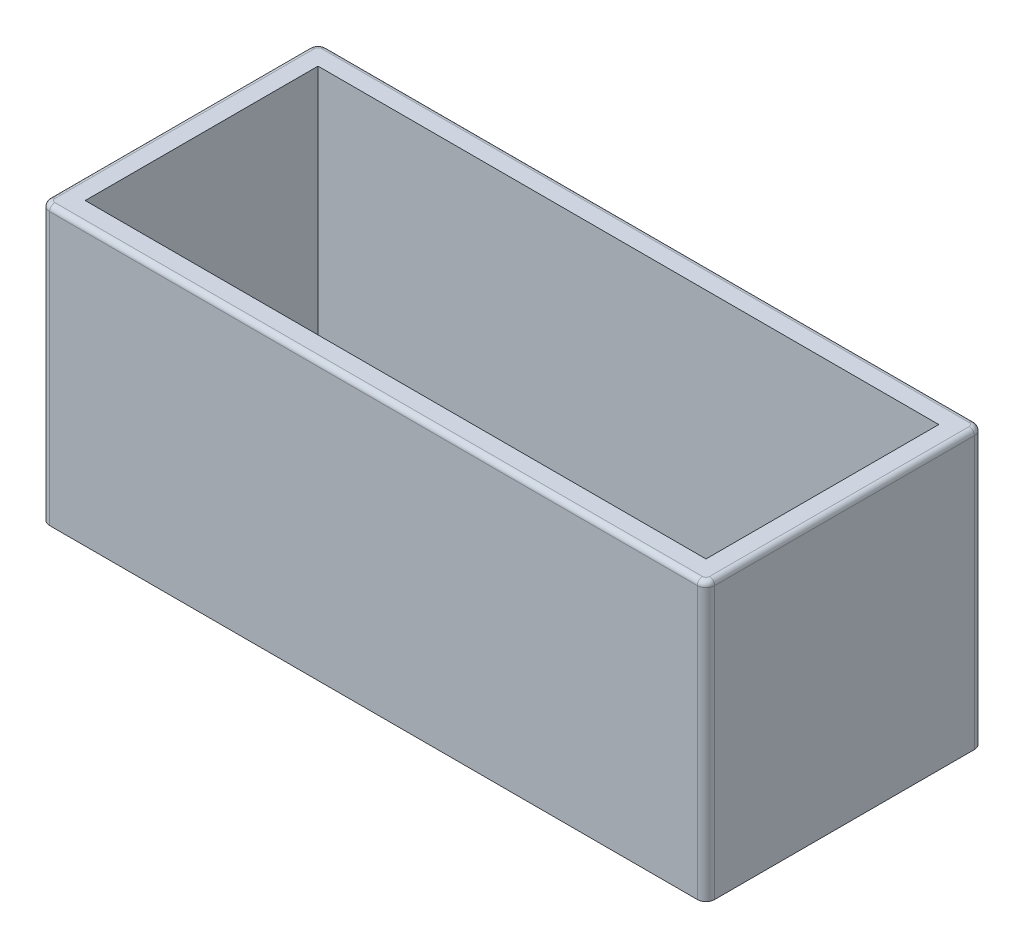
ISO-10303-21;
HEADER;
FILE_DESCRIPTION(('STEP AP214'),'2;1');
FILE_NAME('part.step','',(''),(''),'','','');
FILE_SCHEMA(('AUTOMOTIVE_DESIGN { 1 0 10303 214 1 1 1 1 }'));
ENDSEC;
DATA;
#1=APPLICATION_CONTEXT('core data for automotive mechanical design processes');
#2=APPLICATION_PROTOCOL_DEFINITION('international standard','automotive_design',2000,#1);
#3=PRODUCT_CONTEXT('',#1,'mechanical');
#4=PRODUCT('Part','Part','',(#3));
#5=PRODUCT_RELATED_PRODUCT_CATEGORY('part','',(#4));
#6=PRODUCT_DEFINITION_FORMATION('','',#4);
#7=PRODUCT_DEFINITION_CONTEXT('part definition',#1,'design');
#8=PRODUCT_DEFINITION('design','',#6,#7);
#9=PRODUCT_DEFINITION_SHAPE('','',#8);
#10=(LENGTH_UNIT() NAMED_UNIT(*) SI_UNIT(.MILLI.,.METRE.));
#11=(NAMED_UNIT(*) PLANE_ANGLE_UNIT() SI_UNIT($,.RADIAN.));
#12=(NAMED_UNIT(*) SI_UNIT($,.STERADIAN.) SOLID_ANGLE_UNIT());
#13=UNCERTAINTY_MEASURE_WITH_UNIT(LENGTH_MEASURE(1.E-05),#10,'distance_accuracy_value','');
#14=(GEOMETRIC_REPRESENTATION_CONTEXT(3) GLOBAL_UNCERTAINTY_ASSIGNED_CONTEXT((#13)) GLOBAL_UNIT_ASSIGNED_CONTEXT((#10,
#11,#12)) REPRESENTATION_CONTEXT('',''));
#15=CARTESIAN_POINT('',(0.,0.,0.));
#16=DIRECTION('',(0.,0.,1.));
#17=DIRECTION('',(1.,0.,0.));
#18=AXIS2_PLACEMENT_3D('',#15,#16,#17);
#19=CARTESIAN_POINT('',(80.772,-8.1191791947345,-1.905));
#20=DIRECTION('',(0.,0.,1.));
#21=DIRECTION('',(1.,0.,0.));
#22=AXIS2_PLACEMENT_3D('',#19,#20,#21);
#23=PLANE('',#22);
#24=DIRECTION('',(0.,1.,0.));
#25=VECTOR('',#24,1.);
#26=CARTESIAN_POINT('',(71.748,-4.30917919473451,-1.905));
#27=LINE('',#26,#25);
#28=CARTESIAN_POINT('',(71.748,-8.1191791947345,-1.905));
#29=VERTEX_POINT('',#28);
#30=CARTESIAN_POINT('',(71.748,-4.3811791947345,-1.905));
#31=VERTEX_POINT('',#30);
#32=EDGE_CURVE('E231',#29,#31,#27,.T.);
#33=ORIENTED_EDGE('',*,*,#32,.T.);
#34=DIRECTION('',(-1.,0.,0.));
#35=VECTOR('',#34,1.);
#36=CARTESIAN_POINT('',(80.772,-4.3811791947345,-1.905));
#37=LINE('',#36,#35);
#38=CARTESIAN_POINT('',(80.652,-4.3811791947345,-1.905));
#39=VERTEX_POINT('',#38);
#40=EDGE_CURVE('E12',#31,#39,#37,.F.);
#41=ORIENTED_EDGE('',*,*,#40,.T.);
#42=DIRECTION('',(0.,1.,0.));
#43=VECTOR('',#42,1.);
#44=CARTESIAN_POINT('',(80.652,-8.1191791947345,-1.905));
#45=LINE('',#44,#43);
#46=CARTESIAN_POINT('',(80.652,-8.1191791947345,-1.905));
#47=VERTEX_POINT('',#46);
#48=EDGE_CURVE('E233',#39,#47,#45,.F.);
#49=ORIENTED_EDGE('',*,*,#48,.T.);
#50=DIRECTION('',(-1.,0.,0.));
#51=VECTOR('',#50,1.);
#52=CARTESIAN_POINT('',(80.772,-8.1191791947345,-1.905));
#53=LINE('',#52,#51);
#54=EDGE_CURVE('E205',#47,#29,#53,.T.);
#55=ORIENTED_EDGE('',*,*,#54,.T.);
#56=EDGE_LOOP('',(#33,#41,#49,#55));
#57=FACE_BOUND('',#56,.T.);
#58=ADVANCED_FACE('F49',(#57),#23,.F.);
#59=CARTESIAN_POINT('',(80.772,-4.30917919473451,1.90499999999999));
#60=DIRECTION('',(0.,-1.,0.));
#61=DIRECTION('',(0.,0.,-1.));
#62=AXIS2_PLACEMENT_3D('',#59,#60,#61);
#63=PLANE('',#62);
#64=DIRECTION('',(0.,0.,1.));
#65=VECTOR('',#64,1.);
#66=CARTESIAN_POINT('',(80.7,-4.30917919473451,1.90499999999999));
#67=LINE('',#66,#65);
#68=CARTESIAN_POINT('',(80.7,-4.30917919473451,1.78499999999999));
#69=VERTEX_POINT('',#68);
#70=CARTESIAN_POINT('',(80.7,-4.30917919473451,-1.78500000000001));
#71=VERTEX_POINT('',#70);
#72=EDGE_CURVE('E251',#69,#71,#67,.F.);
#73=ORIENTED_EDGE('',*,*,#72,.T.);
#74=CARTESIAN_POINT('',(80.652,-4.30917919473451,-1.78500000000001));
#75=DIRECTION('',(0.,-1.,0.));
#76=DIRECTION('',(0.,0.,-1.));
#77=AXIS2_PLACEMENT_3D('',#74,#75,#76);
#78=CIRCLE('',#77,0.048);
#79=CARTESIAN_POINT('',(80.652,-4.30917919473451,-1.83300000000001));
#80=VERTEX_POINT('',#79);
#81=EDGE_CURVE('E253',#71,#80,#78,.F.);
#82=ORIENTED_EDGE('',*,*,#81,.T.);
#83=DIRECTION('',(-1.,0.,0.));
#84=VECTOR('',#83,1.);
#85=CARTESIAN_POINT('',(80.772,-4.30917919473451,-1.83300000000001));
#86=LINE('',#85,#84);
#87=CARTESIAN_POINT('',(71.748,-4.30917919473451,-1.83300000000001));
#88=VERTEX_POINT('',#87);
#89=EDGE_CURVE('E239',#80,#88,#86,.T.);
#90=ORIENTED_EDGE('',*,*,#89,.T.);
#91=CARTESIAN_POINT('',(71.748,-4.30917919473451,-1.78500000000001));
#92=DIRECTION('',(0.,-1.,0.));
#93=DIRECTION('',(0.,0.,-1.));
#94=AXIS2_PLACEMENT_3D('',#91,#92,#93);
#95=CIRCLE('',#94,0.048);
#96=CARTESIAN_POINT('',(71.7,-4.30917919473451,-1.78500000000001));
#97=VERTEX_POINT('',#96);
#98=EDGE_CURVE('E241',#88,#97,#95,.F.);
#99=ORIENTED_EDGE('',*,*,#98,.T.);
#100=DIRECTION('',(0.,0.,1.));
#101=VECTOR('',#100,1.);
#102=CARTESIAN_POINT('',(71.7,-4.30917919473451,1.78499999999999));
#103=LINE('',#102,#101);
#104=CARTESIAN_POINT('',(71.7,-4.30917919473451,1.78499999999999));
#105=VERTEX_POINT('',#104);
#106=EDGE_CURVE('E243',#97,#105,#103,.T.);
#107=ORIENTED_EDGE('',*,*,#106,.T.);
#108=CARTESIAN_POINT('',(71.748,-4.30917919473451,1.78499999999999));
#109=DIRECTION('',(0.,-1.,0.));
#110=DIRECTION('',(0.,0.,-1.));
#111=AXIS2_PLACEMENT_3D('',#108,#109,#110);
#112=CIRCLE('',#111,0.048);
#113=CARTESIAN_POINT('',(71.748,-4.30917919473451,1.83299999999999));
#114=VERTEX_POINT('',#113);
#115=EDGE_CURVE('E245',#105,#114,#112,.F.);
#116=ORIENTED_EDGE('',*,*,#115,.T.);
#117=DIRECTION('',(-1.,0.,0.));
#118=VECTOR('',#117,1.);
#119=CARTESIAN_POINT('',(80.772,-4.30917919473451,1.83299999999999));
#120=LINE('',#119,#118);
#121=CARTESIAN_POINT('',(80.652,-4.30917919473451,1.83299999999999));
#122=VERTEX_POINT('',#121);
#123=EDGE_CURVE('E247',#114,#122,#120,.F.);
#124=ORIENTED_EDGE('',*,*,#123,.T.);
#125=CARTESIAN_POINT('',(80.652,-4.30917919473451,1.78499999999999));
#126=DIRECTION('',(0.,-1.,0.));
#127=DIRECTION('',(0.,0.,-1.));
#128=AXIS2_PLACEMENT_3D('',#125,#126,#127);
#129=CIRCLE('',#128,0.048);
#130=EDGE_CURVE('E249',#122,#69,#129,.F.);
#131=ORIENTED_EDGE('',*,*,#130,.T.);
#132=EDGE_LOOP('',(#73,#82,#90,#99,#107,#116,#124,#131));
#133=FACE_BOUND('',#132,.T.);
#134=DIRECTION('',(0.,0.,1.));
#135=VECTOR('',#134,1.);
#136=CARTESIAN_POINT('',(71.9328,-4.30917919473451,-1.60020000000001));
#137=LINE('',#136,#135);
#138=CARTESIAN_POINT('',(71.9328,-4.30917919473451,-1.60020000000001));
#139=VERTEX_POINT('',#138);
#140=CARTESIAN_POINT('',(71.9328,-4.30917919473451,1.60019999999999));
#141=VERTEX_POINT('',#140);
#142=EDGE_CURVE('E180',#139,#141,#137,.T.);
#143=ORIENTED_EDGE('',*,*,#142,.F.);
#144=DIRECTION('',(-1.,0.,0.));
#145=VECTOR('',#144,1.);
#146=CARTESIAN_POINT('',(80.4672,-4.30917919473451,-1.60020000000001));
#147=LINE('',#146,#145);
#148=CARTESIAN_POINT('',(80.4672,-4.30917919473451,-1.60020000000001));
#149=VERTEX_POINT('',#148);
#150=EDGE_CURVE('E185',#149,#139,#147,.T.);
#151=ORIENTED_EDGE('',*,*,#150,.F.);
#152=DIRECTION('',(0.,0.,-1.));
#153=VECTOR('',#152,1.);
#154=CARTESIAN_POINT('',(80.4672,-4.30917919473451,1.60019999999999));
#155=LINE('',#154,#153);
#156=CARTESIAN_POINT('',(80.4672,-4.30917919473451,1.60019999999999));
#157=VERTEX_POINT('',#156);
#158=EDGE_CURVE('E189',#157,#149,#155,.T.);
#159=ORIENTED_EDGE('',*,*,#158,.F.);
#160=DIRECTION('',(1.,0.,0.));
#161=VECTOR('',#160,1.);
#162=CARTESIAN_POINT('',(71.9328,-4.30917919473451,1.60019999999999));
#163=LINE('',#162,#161);
#164=EDGE_CURVE('E169',#141,#157,#163,.T.);
#165=ORIENTED_EDGE('',*,*,#164,.F.);
#166=EDGE_LOOP('',(#143,#151,#159,#165));
#167=FACE_BOUND('',#166,.T.);
#168=ADVANCED_FACE('F187',(#133,#167),#63,.F.);
#169=CARTESIAN_POINT('',(80.772,-8.1191791947345,1.90499999999999));
#170=DIRECTION('',(0.,0.,-1.));
#171=DIRECTION('',(-1.,0.,0.));
#172=AXIS2_PLACEMENT_3D('',#169,#170,#171);
#173=PLANE('',#172);
#174=DIRECTION('',(0.,-1.,0.));
#175=VECTOR('',#174,1.);
#176=CARTESIAN_POINT('',(80.652,-8.1191791947345,1.90499999999999));
#177=LINE('',#176,#175);
#178=CARTESIAN_POINT('',(80.652,-8.1191791947345,1.90499999999999));
#179=VERTEX_POINT('',#178);
#180=CARTESIAN_POINT('',(80.652,-4.3811791947345,1.90499999999999));
#181=VERTEX_POINT('',#180);
#182=EDGE_CURVE('E228',#179,#181,#177,.F.);
#183=ORIENTED_EDGE('',*,*,#182,.T.);
#184=DIRECTION('',(-1.,0.,0.));
#185=VECTOR('',#184,1.);
#186=CARTESIAN_POINT('',(80.772,-4.3811791947345,1.90499999999999));
#187=LINE('',#186,#185);
#188=CARTESIAN_POINT('',(71.748,-4.3811791947345,1.90499999999999));
#189=VERTEX_POINT('',#188);
#190=EDGE_CURVE('E263',#181,#189,#187,.T.);
#191=ORIENTED_EDGE('',*,*,#190,.T.);
#192=DIRECTION('',(0.,-1.,0.));
#193=VECTOR('',#192,1.);
#194=CARTESIAN_POINT('',(71.748,-8.1191791947345,1.90499999999999));
#195=LINE('',#194,#193);
#196=CARTESIAN_POINT('',(71.748,-8.1191791947345,1.90499999999999));
#197=VERTEX_POINT('',#196);
#198=EDGE_CURVE('E226',#189,#197,#195,.T.);
#199=ORIENTED_EDGE('',*,*,#198,.T.);
#200=DIRECTION('',(-1.,0.,0.));
#201=VECTOR('',#200,1.);
#202=CARTESIAN_POINT('',(80.772,-8.1191791947345,1.90499999999999));
#203=LINE('',#202,#201);
#204=EDGE_CURVE('E210',#179,#197,#203,.T.);
#205=ORIENTED_EDGE('',*,*,#204,.F.);
#206=EDGE_LOOP('',(#183,#191,#199,#205));
#207=FACE_BOUND('',#206,.T.);
#208=ADVANCED_FACE('F325',(#207),#173,.F.);
#209=CARTESIAN_POINT('',(80.772,-8.1191791947345,1.90499999999999));
#210=DIRECTION('',(0.,1.,0.));
#211=DIRECTION('',(0.,0.,1.));
#212=AXIS2_PLACEMENT_3D('',#209,#210,#211);
#213=PLANE('',#212);
#214=DIRECTION('',(0.,0.,-1.));
#215=VECTOR('',#214,1.);
#216=CARTESIAN_POINT('',(80.772,-8.1191791947345,1.90499999999999));
#217=LINE('',#216,#215);
#218=CARTESIAN_POINT('',(80.772,-8.1191791947345,1.78499999999999));
#219=VERTEX_POINT('',#218);
#220=CARTESIAN_POINT('',(80.772,-8.1191791947345,-1.78500000000001));
#221=VERTEX_POINT('',#220);
#222=EDGE_CURVE('E202',#219,#221,#217,.T.);
#223=ORIENTED_EDGE('',*,*,#222,.F.);
#224=CARTESIAN_POINT('',(80.652,-8.1191791947345,1.78499999999999));
#225=DIRECTION('',(0.,1.,0.));
#226=DIRECTION('',(0.,0.,1.));
#227=AXIS2_PLACEMENT_3D('',#224,#225,#226);
#228=CIRCLE('',#227,0.12);
#229=EDGE_CURVE('E224',#219,#179,#228,.F.);
#230=ORIENTED_EDGE('',*,*,#229,.T.);
#231=ORIENTED_EDGE('',*,*,#204,.T.);
#232=CARTESIAN_POINT('',(71.748,-8.1191791947345,1.78499999999999));
#233=DIRECTION('',(0.,1.,0.));
#234=DIRECTION('',(0.,0.,1.));
#235=AXIS2_PLACEMENT_3D('',#232,#233,#234);
#236=CIRCLE('',#235,0.12);
#237=CARTESIAN_POINT('',(71.628,-8.1191791947345,1.78499999999999));
#238=VERTEX_POINT('',#237);
#239=EDGE_CURVE('E218',#197,#238,#236,.F.);
#240=ORIENTED_EDGE('',*,*,#239,.T.);
#241=DIRECTION('',(0.,0.,-1.));
#242=VECTOR('',#241,1.);
#243=CARTESIAN_POINT('',(71.628,-8.1191791947345,1.90499999999999));
#244=LINE('',#243,#242);
#245=CARTESIAN_POINT('',(71.628,-8.1191791947345,-1.78500000000001));
#246=VERTEX_POINT('',#245);
#247=EDGE_CURVE('E200',#238,#246,#244,.T.);
#248=ORIENTED_EDGE('',*,*,#247,.T.);
#249=CARTESIAN_POINT('',(71.748,-8.1191791947345,-1.78500000000001));
#250=DIRECTION('',(0.,1.,0.));
#251=DIRECTION('',(0.,0.,1.));
#252=AXIS2_PLACEMENT_3D('',#249,#250,#251);
#253=CIRCLE('',#252,0.12);
#254=EDGE_CURVE('E220',#246,#29,#253,.F.);
#255=ORIENTED_EDGE('',*,*,#254,.T.);
#256=ORIENTED_EDGE('',*,*,#54,.F.);
#257=CARTESIAN_POINT('',(80.652,-8.1191791947345,-1.78500000000001));
#258=DIRECTION('',(0.,1.,0.));
#259=DIRECTION('',(0.,0.,1.));
#260=AXIS2_PLACEMENT_3D('',#257,#258,#259);
#261=CIRCLE('',#260,0.12);
#262=EDGE_CURVE('E222',#47,#221,#261,.F.);
#263=ORIENTED_EDGE('',*,*,#262,.T.);
#264=EDGE_LOOP('',(#223,#230,#231,#240,#248,#255,#256,#263));
#265=FACE_BOUND('',#264,.T.);
#266=ADVANCED_FACE('F408',(#265),#213,.F.);
#267=CARTESIAN_POINT('',(80.772,-6.2141791947345,0.));
#268=DIRECTION('',(-1.,0.,0.));
#269=DIRECTION('',(0.,0.,1.));
#270=AXIS2_PLACEMENT_3D('',#267,#268,#269);
#271=PLANE('',#270);
#272=DIRECTION('',(0.,1.,0.));
#273=VECTOR('',#272,1.);
#274=CARTESIAN_POINT('',(80.772,-6.2141791947345,-1.78500000000001));
#275=LINE('',#274,#273);
#276=CARTESIAN_POINT('',(80.772,-4.3811791947345,-1.78500000000001));
#277=VERTEX_POINT('',#276);
#278=EDGE_CURVE('E213',#221,#277,#275,.T.);
#279=ORIENTED_EDGE('',*,*,#278,.T.);
#280=DIRECTION('',(0.,0.,1.));
#281=VECTOR('',#280,1.);
#282=CARTESIAN_POINT('',(80.772,-4.3811791947345,0.));
#283=LINE('',#282,#281);
#284=CARTESIAN_POINT('',(80.772,-4.3811791947345,1.78499999999999));
#285=VERTEX_POINT('',#284);
#286=EDGE_CURVE('E259',#277,#285,#283,.T.);
#287=ORIENTED_EDGE('',*,*,#286,.T.);
#288=DIRECTION('',(0.,-1.,0.));
#289=VECTOR('',#288,1.);
#290=CARTESIAN_POINT('',(80.772,-6.2141791947345,1.78499999999999));
#291=LINE('',#290,#289);
#292=EDGE_CURVE('E216',#285,#219,#291,.T.);
#293=ORIENTED_EDGE('',*,*,#292,.T.);
#294=ORIENTED_EDGE('',*,*,#222,.T.);
#295=EDGE_LOOP('',(#279,#287,#293,#294));
#296=FACE_BOUND('',#295,.T.);
#297=ADVANCED_FACE('F315',(#296),#271,.F.);
#298=CARTESIAN_POINT('',(71.628,-6.2141791947345,0.));
#299=DIRECTION('',(-1.,0.,0.));
#300=DIRECTION('',(0.,0.,1.));
#301=AXIS2_PLACEMENT_3D('',#298,#299,#300);
#302=PLANE('',#301);
#303=DIRECTION('',(0.,-1.,0.));
#304=VECTOR('',#303,1.);
#305=CARTESIAN_POINT('',(71.628,-4.30917919473451,1.78499999999999));
#306=LINE('',#305,#304);
#307=CARTESIAN_POINT('',(71.628,-4.3811791947345,1.78499999999999));
#308=VERTEX_POINT('',#307);
#309=EDGE_CURVE('E235',#238,#308,#306,.F.);
#310=ORIENTED_EDGE('',*,*,#309,.T.);
#311=DIRECTION('',(0.,0.,1.));
#312=VECTOR('',#311,1.);
#313=CARTESIAN_POINT('',(71.628,-4.3811791947345,-1.78500000000001));
#314=LINE('',#313,#312);
#315=CARTESIAN_POINT('',(71.628,-4.3811791947345,-1.78500000000001));
#316=VERTEX_POINT('',#315);
#317=EDGE_CURVE('E73',#308,#316,#314,.F.);
#318=ORIENTED_EDGE('',*,*,#317,.T.);
#319=DIRECTION('',(0.,1.,0.));
#320=VECTOR('',#319,1.);
#321=CARTESIAN_POINT('',(71.628,-8.1191791947345,-1.78500000000001));
#322=LINE('',#321,#320);
#323=EDGE_CURVE('E237',#316,#246,#322,.F.);
#324=ORIENTED_EDGE('',*,*,#323,.T.);
#325=ORIENTED_EDGE('',*,*,#247,.F.);
#326=EDGE_LOOP('',(#310,#318,#324,#325));
#327=FACE_BOUND('',#326,.T.);
#328=ADVANCED_FACE('F308',(#327),#302,.T.);
#329=CARTESIAN_POINT('',(80.4672,-17.2339223902393,-1.60020000000001));
#330=DIRECTION('',(0.,0.,-1.));
#331=DIRECTION('',(-1.,0.,0.));
#332=AXIS2_PLACEMENT_3D('',#329,#330,#331);
#333=PLANE('',#332);
#334=DIRECTION('',(1.,0.,0.));
#335=VECTOR('',#334,1.);
#336=CARTESIAN_POINT('',(80.4672,-7.8143791947345,-1.60020000000001));
#337=LINE('',#336,#335);
#338=CARTESIAN_POINT('',(71.9328,-7.8143791947345,-1.60020000000001));
#339=VERTEX_POINT('',#338);
#340=CARTESIAN_POINT('',(80.4672,-7.8143791947345,-1.60020000000001));
#341=VERTEX_POINT('',#340);
#342=EDGE_CURVE('E201',#339,#341,#337,.T.);
#343=ORIENTED_EDGE('',*,*,#342,.T.);
#344=DIRECTION('',(0.,1.,0.));
#345=VECTOR('',#344,1.);
#346=CARTESIAN_POINT('',(80.4672,-17.2339223902393,-1.60020000000001));
#347=LINE('',#346,#345);
#348=EDGE_CURVE('E194',#341,#149,#347,.T.);
#349=ORIENTED_EDGE('',*,*,#348,.T.);
#350=ORIENTED_EDGE('',*,*,#150,.T.);
#351=DIRECTION('',(0.,1.,0.));
#352=VECTOR('',#351,1.);
#353=CARTESIAN_POINT('',(71.9328,-17.2339223902393,-1.60020000000001));
#354=LINE('',#353,#352);
#355=EDGE_CURVE('E176',#339,#139,#354,.T.);
#356=ORIENTED_EDGE('',*,*,#355,.F.);
#357=EDGE_LOOP('',(#343,#349,#350,#356));
#358=FACE_BOUND('',#357,.T.);
#359=ADVANCED_FACE('F306',(#358),#333,.F.);
#360=CARTESIAN_POINT('',(80.4672,-17.2339223902393,1.60019999999999));
#361=DIRECTION('',(1.,0.,0.));
#362=DIRECTION('',(0.,0.,-1.));
#363=AXIS2_PLACEMENT_3D('',#360,#361,#362);
#364=PLANE('',#363);
#365=DIRECTION('',(0.,0.,1.));
#366=VECTOR('',#365,1.);
#367=CARTESIAN_POINT('',(80.4672,-7.8143791947345,1.60019999999999));
#368=LINE('',#367,#366);
#369=CARTESIAN_POINT('',(80.4672,-7.8143791947345,1.60019999999999));
#370=VERTEX_POINT('',#369);
#371=EDGE_CURVE('E297',#341,#370,#368,.T.);
#372=ORIENTED_EDGE('',*,*,#371,.T.);
#373=DIRECTION('',(0.,1.,0.));
#374=VECTOR('',#373,1.);
#375=CARTESIAN_POINT('',(80.4672,-17.2339223902393,1.60019999999999));
#376=LINE('',#375,#374);
#377=EDGE_CURVE('E175',#370,#157,#376,.T.);
#378=ORIENTED_EDGE('',*,*,#377,.T.);
#379=ORIENTED_EDGE('',*,*,#158,.T.);
#380=ORIENTED_EDGE('',*,*,#348,.F.);
#381=EDGE_LOOP('',(#372,#378,#379,#380));
#382=FACE_BOUND('',#381,.T.);
#383=ADVANCED_FACE('F302',(#382),#364,.F.);
#384=CARTESIAN_POINT('',(71.9328,-17.2339223902393,1.60019999999999));
#385=DIRECTION('',(0.,0.,1.));
#386=DIRECTION('',(1.,0.,0.));
#387=AXIS2_PLACEMENT_3D('',#384,#385,#386);
#388=PLANE('',#387);
#389=DIRECTION('',(-1.,0.,0.));
#390=VECTOR('',#389,1.);
#391=CARTESIAN_POINT('',(71.9328,-7.8143791947345,1.60019999999999));
#392=LINE('',#391,#390);
#393=CARTESIAN_POINT('',(71.9328,-7.8143791947345,1.60019999999999));
#394=VERTEX_POINT('',#393);
#395=EDGE_CURVE('E172',#370,#394,#392,.T.);
#396=ORIENTED_EDGE('',*,*,#395,.T.);
#397=DIRECTION('',(0.,1.,0.));
#398=VECTOR('',#397,1.);
#399=CARTESIAN_POINT('',(71.9328,-17.2339223902393,1.60019999999999));
#400=LINE('',#399,#398);
#401=EDGE_CURVE('E164',#394,#141,#400,.T.);
#402=ORIENTED_EDGE('',*,*,#401,.T.);
#403=ORIENTED_EDGE('',*,*,#164,.T.);
#404=ORIENTED_EDGE('',*,*,#377,.F.);
#405=EDGE_LOOP('',(#396,#402,#403,#404));
#406=FACE_BOUND('',#405,.T.);
#407=ADVANCED_FACE('F166',(#406),#388,.F.);
#408=CARTESIAN_POINT('',(71.9328,-17.2339223902393,-1.60020000000001));
#409=DIRECTION('',(-1.,0.,0.));
#410=DIRECTION('',(0.,0.,1.));
#411=AXIS2_PLACEMENT_3D('',#408,#409,#410);
#412=PLANE('',#411);
#413=DIRECTION('',(0.,0.,-1.));
#414=VECTOR('',#413,1.);
#415=CARTESIAN_POINT('',(71.9328,-7.8143791947345,-1.60020000000001));
#416=LINE('',#415,#414);
#417=EDGE_CURVE('E198',#394,#339,#416,.T.);
#418=ORIENTED_EDGE('',*,*,#417,.T.);
#419=ORIENTED_EDGE('',*,*,#355,.T.);
#420=ORIENTED_EDGE('',*,*,#142,.T.);
#421=ORIENTED_EDGE('',*,*,#401,.F.);
#422=EDGE_LOOP('',(#418,#419,#420,#421));
#423=FACE_BOUND('',#422,.T.);
#424=ADVANCED_FACE('F181',(#423),#412,.F.);
#425=CARTESIAN_POINT('',(80.772,-7.8143791947345,1.90499999999999));
#426=DIRECTION('',(0.,1.,0.));
#427=DIRECTION('',(0.,0.,1.));
#428=AXIS2_PLACEMENT_3D('',#425,#426,#427);
#429=PLANE('',#428);
#430=ORIENTED_EDGE('',*,*,#342,.F.);
#431=ORIENTED_EDGE('',*,*,#417,.F.);
#432=ORIENTED_EDGE('',*,*,#395,.F.);
#433=ORIENTED_EDGE('',*,*,#371,.F.);
#434=EDGE_LOOP('',(#430,#431,#432,#433));
#435=FACE_BOUND('',#434,.T.);
#436=ADVANCED_FACE('F305',(#435),#429,.T.);
#437=CARTESIAN_POINT('',(80.652,-6.2141791947345,1.78499999999999));
#438=DIRECTION('',(0.,-1.,0.));
#439=DIRECTION('',(0.,0.,-1.));
#440=AXIS2_PLACEMENT_3D('',#437,#438,#439);
#441=CYLINDRICAL_SURFACE('',#440,0.12);
#442=ORIENTED_EDGE('',*,*,#292,.F.);
#443=CARTESIAN_POINT('',(80.652,-4.3811791947345,1.78499999999999));
#444=DIRECTION('',(0.,-1.,0.));
#445=DIRECTION('',(0.,0.,-1.));
#446=AXIS2_PLACEMENT_3D('',#443,#444,#445);
#447=CIRCLE('',#446,0.12);
#448=EDGE_CURVE('E261',#285,#181,#447,.T.);
#449=ORIENTED_EDGE('',*,*,#448,.T.);
#450=ORIENTED_EDGE('',*,*,#182,.F.);
#451=ORIENTED_EDGE('',*,*,#229,.F.);
#452=EDGE_LOOP('',(#442,#449,#450,#451));
#453=FACE_BOUND('',#452,.T.);
#454=ADVANCED_FACE('F330',(#453),#441,.T.);
#455=CARTESIAN_POINT('',(80.652,-6.2141791947345,-1.78500000000001));
#456=DIRECTION('',(0.,1.,0.));
#457=DIRECTION('',(0.,0.,1.));
#458=AXIS2_PLACEMENT_3D('',#455,#456,#457);
#459=CYLINDRICAL_SURFACE('',#458,0.12);
#460=ORIENTED_EDGE('',*,*,#48,.F.);
#461=CARTESIAN_POINT('',(80.652,-4.3811791947345,-1.78500000000001));
#462=DIRECTION('',(0.,-1.,0.));
#463=DIRECTION('',(0.,0.,-1.));
#464=AXIS2_PLACEMENT_3D('',#461,#462,#463);
#465=CIRCLE('',#464,0.12);
#466=EDGE_CURVE('E256',#39,#277,#465,.T.);
#467=ORIENTED_EDGE('',*,*,#466,.T.);
#468=ORIENTED_EDGE('',*,*,#278,.F.);
#469=ORIENTED_EDGE('',*,*,#262,.F.);
#470=EDGE_LOOP('',(#460,#467,#468,#469));
#471=FACE_BOUND('',#470,.T.);
#472=ADVANCED_FACE('F333',(#471),#459,.T.);
#473=CARTESIAN_POINT('',(71.748,-8.1191791947345,-1.78500000000001));
#474=DIRECTION('',(0.,-1.,0.));
#475=DIRECTION('',(0.,0.,-1.));
#476=AXIS2_PLACEMENT_3D('',#473,#474,#475);
#477=CYLINDRICAL_SURFACE('',#476,0.12);
#478=ORIENTED_EDGE('',*,*,#323,.F.);
#479=CARTESIAN_POINT('',(71.748,-4.3811791947345,-1.78500000000001));
#480=DIRECTION('',(0.,-1.,0.));
#481=DIRECTION('',(0.,0.,-1.));
#482=AXIS2_PLACEMENT_3D('',#479,#480,#481);
#483=CIRCLE('',#482,0.12);
#484=EDGE_CURVE('E58',#316,#31,#483,.T.);
#485=ORIENTED_EDGE('',*,*,#484,.T.);
#486=ORIENTED_EDGE('',*,*,#32,.F.);
#487=ORIENTED_EDGE('',*,*,#254,.F.);
#488=EDGE_LOOP('',(#478,#485,#486,#487));
#489=FACE_BOUND('',#488,.T.);
#490=ADVANCED_FACE('F337',(#489),#477,.T.);
#491=CARTESIAN_POINT('',(71.748,-8.1191791947345,1.78499999999999));
#492=DIRECTION('',(0.,1.,0.));
#493=DIRECTION('',(0.,0.,1.));
#494=AXIS2_PLACEMENT_3D('',#491,#492,#493);
#495=CYLINDRICAL_SURFACE('',#494,0.12);
#496=ORIENTED_EDGE('',*,*,#198,.F.);
#497=CARTESIAN_POINT('',(71.748,-4.3811791947345,1.78499999999999));
#498=DIRECTION('',(0.,-1.,0.));
#499=DIRECTION('',(0.,0.,-1.));
#500=AXIS2_PLACEMENT_3D('',#497,#498,#499);
#501=CIRCLE('',#500,0.12);
#502=EDGE_CURVE('E265',#189,#308,#501,.T.);
#503=ORIENTED_EDGE('',*,*,#502,.T.);
#504=ORIENTED_EDGE('',*,*,#309,.F.);
#505=ORIENTED_EDGE('',*,*,#239,.F.);
#506=EDGE_LOOP('',(#496,#503,#504,#505));
#507=FACE_BOUND('',#506,.T.);
#508=ADVANCED_FACE('F341',(#507),#495,.T.);
#509=CARTESIAN_POINT('',(71.748,-4.3811791947345,1.78499999999999));
#510=DIRECTION('',(0.,-1.,0.));
#511=DIRECTION('',(0.,0.,-1.));
#512=AXIS2_PLACEMENT_3D('',#509,#510,#511);
#513=DEGENERATE_TOROIDAL_SURFACE('',#512,0.048,0.072,.T.);
#514=CARTESIAN_POINT('',(71.7,-4.3811791947345,1.78499999999999));
#515=DIRECTION('',(0.,0.,-1.));
#516=DIRECTION('',(-1.,0.,0.));
#517=AXIS2_PLACEMENT_3D('',#514,#515,#516);
#518=CIRCLE('',#517,0.072);
#519=EDGE_CURVE('E284',#308,#105,#518,.T.);
#520=ORIENTED_EDGE('',*,*,#519,.F.);
#521=ORIENTED_EDGE('',*,*,#502,.F.);
#522=CARTESIAN_POINT('',(71.748,-4.3811791947345,1.83299999999999));
#523=DIRECTION('',(1.,0.,0.));
#524=DIRECTION('',(0.,0.,-1.));
#525=AXIS2_PLACEMENT_3D('',#522,#523,#524);
#526=CIRCLE('',#525,0.072);
#527=EDGE_CURVE('E53',#114,#189,#526,.T.);
#528=ORIENTED_EDGE('',*,*,#527,.F.);
#529=ORIENTED_EDGE('',*,*,#115,.F.);
#530=EDGE_LOOP('',(#520,#521,#528,#529));
#531=FACE_BOUND('',#530,.T.);
#532=ADVANCED_FACE('F51',(#531),#513,.T.);
#533=CARTESIAN_POINT('',(80.772,-4.3811791947345,1.83299999999999));
#534=DIRECTION('',(-1.,0.,0.));
#535=DIRECTION('',(0.,0.,1.));
#536=AXIS2_PLACEMENT_3D('',#533,#534,#535);
#537=CYLINDRICAL_SURFACE('',#536,0.072);
#538=ORIENTED_EDGE('',*,*,#527,.T.);
#539=ORIENTED_EDGE('',*,*,#190,.F.);
#540=CARTESIAN_POINT('',(80.652,-4.3811791947345,1.83299999999999));
#541=DIRECTION('',(1.,0.,0.));
#542=DIRECTION('',(0.,0.,-1.));
#543=AXIS2_PLACEMENT_3D('',#540,#541,#542);
#544=CIRCLE('',#543,0.072);
#545=EDGE_CURVE('E282',#122,#181,#544,.T.);
#546=ORIENTED_EDGE('',*,*,#545,.F.);
#547=ORIENTED_EDGE('',*,*,#123,.F.);
#548=EDGE_LOOP('',(#538,#539,#546,#547));
#549=FACE_BOUND('',#548,.T.);
#550=ADVANCED_FACE('F367',(#549),#537,.T.);
#551=CARTESIAN_POINT('',(71.7,-4.3811791947345,1.90499999999999));
#552=DIRECTION('',(0.,0.,-1.));
#553=DIRECTION('',(-1.,0.,0.));
#554=AXIS2_PLACEMENT_3D('',#551,#552,#553);
#555=CYLINDRICAL_SURFACE('',#554,0.072);
#556=ORIENTED_EDGE('',*,*,#519,.T.);
#557=ORIENTED_EDGE('',*,*,#106,.F.);
#558=CARTESIAN_POINT('',(71.7,-4.3811791947345,-1.78500000000001));
#559=DIRECTION('',(0.,0.,-1.));
#560=DIRECTION('',(-1.,0.,0.));
#561=AXIS2_PLACEMENT_3D('',#558,#559,#560);
#562=CIRCLE('',#561,0.072);
#563=EDGE_CURVE('E279',#316,#97,#562,.T.);
#564=ORIENTED_EDGE('',*,*,#563,.F.);
#565=ORIENTED_EDGE('',*,*,#317,.F.);
#566=EDGE_LOOP('',(#556,#557,#564,#565));
#567=FACE_BOUND('',#566,.T.);
#568=ADVANCED_FACE('F364',(#567),#555,.T.);
#569=CARTESIAN_POINT('',(80.652,-4.3811791947345,1.78499999999999));
#570=DIRECTION('',(0.,-1.,0.));
#571=DIRECTION('',(0.,0.,-1.));
#572=AXIS2_PLACEMENT_3D('',#569,#570,#571);
#573=DEGENERATE_TOROIDAL_SURFACE('',#572,0.048,0.072,.T.);
#574=ORIENTED_EDGE('',*,*,#545,.T.);
#575=ORIENTED_EDGE('',*,*,#448,.F.);
#576=CARTESIAN_POINT('',(80.7,-4.3811791947345,1.78499999999999));
#577=DIRECTION('',(0.,0.,-1.));
#578=DIRECTION('',(-1.,0.,0.));
#579=AXIS2_PLACEMENT_3D('',#576,#577,#578);
#580=CIRCLE('',#579,0.072);
#581=EDGE_CURVE('E276',#69,#285,#580,.T.);
#582=ORIENTED_EDGE('',*,*,#581,.F.);
#583=ORIENTED_EDGE('',*,*,#130,.F.);
#584=EDGE_LOOP('',(#574,#575,#582,#583));
#585=FACE_BOUND('',#584,.T.);
#586=ADVANCED_FACE('F360',(#585),#573,.T.);
#587=CARTESIAN_POINT('',(71.748,-4.3811791947345,-1.78500000000001));
#588=DIRECTION('',(0.,-1.,0.));
#589=DIRECTION('',(0.,0.,-1.));
#590=AXIS2_PLACEMENT_3D('',#587,#588,#589);
#591=DEGENERATE_TOROIDAL_SURFACE('',#590,0.048,0.072,.T.);
#592=ORIENTED_EDGE('',*,*,#563,.T.);
#593=ORIENTED_EDGE('',*,*,#98,.F.);
#594=CARTESIAN_POINT('',(71.748,-4.3811791947345,-1.83300000000001));
#595=DIRECTION('',(1.,0.,0.));
#596=DIRECTION('',(0.,0.,-1.));
#597=AXIS2_PLACEMENT_3D('',#594,#595,#596);
#598=CIRCLE('',#597,0.072);
#599=EDGE_CURVE('E273',#31,#88,#598,.T.);
#600=ORIENTED_EDGE('',*,*,#599,.F.);
#601=ORIENTED_EDGE('',*,*,#484,.F.);
#602=EDGE_LOOP('',(#592,#593,#600,#601));
#603=FACE_BOUND('',#602,.T.);
#604=ADVANCED_FACE('F356',(#603),#591,.T.);
#605=CARTESIAN_POINT('',(80.7,-4.3811791947345,0.));
#606=DIRECTION('',(0.,0.,1.));
#607=DIRECTION('',(1.,0.,0.));
#608=AXIS2_PLACEMENT_3D('',#605,#606,#607);
#609=CYLINDRICAL_SURFACE('',#608,0.072);
#610=ORIENTED_EDGE('',*,*,#581,.T.);
#611=ORIENTED_EDGE('',*,*,#286,.F.);
#612=CARTESIAN_POINT('',(80.7,-4.3811791947345,-1.78500000000001));
#613=DIRECTION('',(0.,0.,-1.));
#614=DIRECTION('',(-1.,0.,0.));
#615=AXIS2_PLACEMENT_3D('',#612,#613,#614);
#616=CIRCLE('',#615,0.072);
#617=EDGE_CURVE('E271',#71,#277,#616,.T.);
#618=ORIENTED_EDGE('',*,*,#617,.F.);
#619=ORIENTED_EDGE('',*,*,#72,.F.);
#620=EDGE_LOOP('',(#610,#611,#618,#619));
#621=FACE_BOUND('',#620,.T.);
#622=ADVANCED_FACE('F352',(#621),#609,.T.);
#623=CARTESIAN_POINT('',(80.772,-4.3811791947345,-1.83300000000001));
#624=DIRECTION('',(-1.,0.,0.));
#625=DIRECTION('',(0.,0.,1.));
#626=AXIS2_PLACEMENT_3D('',#623,#624,#625);
#627=CYLINDRICAL_SURFACE('',#626,0.072);
#628=ORIENTED_EDGE('',*,*,#599,.T.);
#629=ORIENTED_EDGE('',*,*,#89,.F.);
#630=CARTESIAN_POINT('',(80.652,-4.3811791947345,-1.83300000000001));
#631=DIRECTION('',(1.,0.,0.));
#632=DIRECTION('',(0.,0.,-1.));
#633=AXIS2_PLACEMENT_3D('',#630,#631,#632);
#634=CIRCLE('',#633,0.072);
#635=EDGE_CURVE('E269',#39,#80,#634,.T.);
#636=ORIENTED_EDGE('',*,*,#635,.F.);
#637=ORIENTED_EDGE('',*,*,#40,.F.);
#638=EDGE_LOOP('',(#628,#629,#636,#637));
#639=FACE_BOUND('',#638,.T.);
#640=ADVANCED_FACE('F348',(#639),#627,.T.);
#641=CARTESIAN_POINT('',(80.652,-4.3811791947345,-1.78500000000001));
#642=DIRECTION('',(0.,-1.,0.));
#643=DIRECTION('',(0.,0.,-1.));
#644=AXIS2_PLACEMENT_3D('',#641,#642,#643);
#645=DEGENERATE_TOROIDAL_SURFACE('',#644,0.048,0.072,.T.);
#646=ORIENTED_EDGE('',*,*,#617,.T.);
#647=ORIENTED_EDGE('',*,*,#466,.F.);
#648=ORIENTED_EDGE('',*,*,#635,.T.);
#649=ORIENTED_EDGE('',*,*,#81,.F.);
#650=EDGE_LOOP('',(#646,#647,#648,#649));
#651=FACE_BOUND('',#650,.T.);
#652=ADVANCED_FACE('F345',(#651),#645,.T.);
#653=CLOSED_SHELL('',(#58,#168,#208,#266,#297,#328,#359,#383,#407,#424,#436,#454,#472,#490,#508,
#532,#550,#568,#586,#604,#622,#640,#652));
#654=MANIFOLD_SOLID_BREP('B2',#653);
#655=ADVANCED_BREP_SHAPE_REPRESENTATION('',(#18,#654),#14);
#656=SHAPE_DEFINITION_REPRESENTATION(#9,#655);
ENDSEC;
END-ISO-10303-21;
